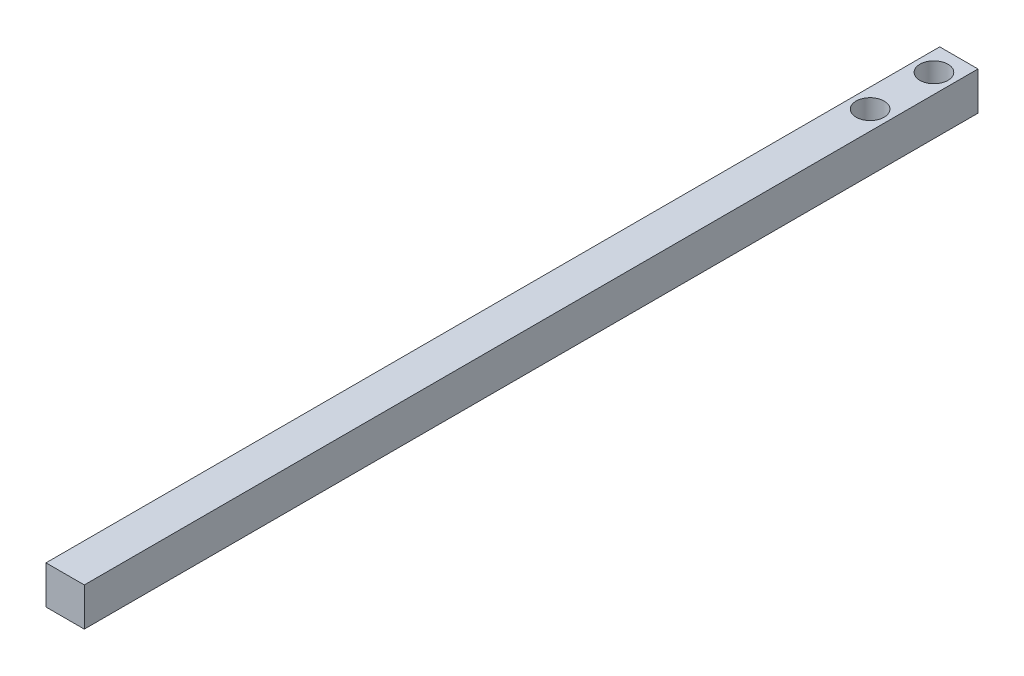
ISO-10303-21;
HEADER;
FILE_DESCRIPTION(('STEP AP214'),'2;1');
FILE_NAME('part.step','',(''),(''),'','','');
FILE_SCHEMA(('AUTOMOTIVE_DESIGN { 1 0 10303 214 1 1 1 1 }'));
ENDSEC;
DATA;
#1=APPLICATION_CONTEXT('core data for automotive mechanical design processes');
#2=APPLICATION_PROTOCOL_DEFINITION('international standard','automotive_design',2000,#1);
#3=PRODUCT_CONTEXT('',#1,'mechanical');
#4=PRODUCT('Part','Part','',(#3));
#5=PRODUCT_RELATED_PRODUCT_CATEGORY('part','',(#4));
#6=PRODUCT_DEFINITION_FORMATION('','',#4);
#7=PRODUCT_DEFINITION_CONTEXT('part definition',#1,'design');
#8=PRODUCT_DEFINITION('design','',#6,#7);
#9=PRODUCT_DEFINITION_SHAPE('','',#8);
#10=(LENGTH_UNIT() NAMED_UNIT(*) SI_UNIT(.MILLI.,.METRE.));
#11=(NAMED_UNIT(*) PLANE_ANGLE_UNIT() SI_UNIT($,.RADIAN.));
#12=(NAMED_UNIT(*) SI_UNIT($,.STERADIAN.) SOLID_ANGLE_UNIT());
#13=UNCERTAINTY_MEASURE_WITH_UNIT(LENGTH_MEASURE(1.E-05),#10,'distance_accuracy_value','');
#14=(GEOMETRIC_REPRESENTATION_CONTEXT(3) GLOBAL_UNCERTAINTY_ASSIGNED_CONTEXT((#13)) GLOBAL_UNIT_ASSIGNED_CONTEXT((#10,
#11,#12)) REPRESENTATION_CONTEXT('',''));
#15=CARTESIAN_POINT('',(0.,0.,0.));
#16=DIRECTION('',(0.,0.,1.));
#17=DIRECTION('',(1.,0.,0.));
#18=AXIS2_PLACEMENT_3D('',#15,#16,#17);
#19=CARTESIAN_POINT('',(0.,3.,0.));
#20=DIRECTION('',(1.,0.,0.));
#21=DIRECTION('',(0.,0.,-1.));
#22=AXIS2_PLACEMENT_3D('',#19,#20,#21);
#23=PLANE('',#22);
#24=DIRECTION('',(0.,0.,1.));
#25=VECTOR('',#24,1.);
#26=CARTESIAN_POINT('',(0.,0.,0.));
#27=LINE('',#26,#25);
#28=CARTESIAN_POINT('',(0.,0.,-70.));
#29=VERTEX_POINT('',#28);
#30=CARTESIAN_POINT('',(0.,0.,0.));
#31=VERTEX_POINT('',#30);
#32=EDGE_CURVE('E96',#29,#31,#27,.T.);
#33=ORIENTED_EDGE('',*,*,#32,.T.);
#34=DIRECTION('',(0.,-1.,0.));
#35=VECTOR('',#34,1.);
#36=CARTESIAN_POINT('',(0.,3.,0.));
#37=LINE('',#36,#35);
#38=CARTESIAN_POINT('',(0.,3.,0.));
#39=VERTEX_POINT('',#38);
#40=EDGE_CURVE('E11',#39,#31,#37,.T.);
#41=ORIENTED_EDGE('',*,*,#40,.F.);
#42=DIRECTION('',(0.,0.,1.));
#43=VECTOR('',#42,1.);
#44=CARTESIAN_POINT('',(0.,3.,0.));
#45=LINE('',#44,#43);
#46=CARTESIAN_POINT('',(0.,3.,-70.));
#47=VERTEX_POINT('',#46);
#48=EDGE_CURVE('E84',#47,#39,#45,.T.);
#49=ORIENTED_EDGE('',*,*,#48,.F.);
#50=DIRECTION('',(0.,-1.,0.));
#51=VECTOR('',#50,1.);
#52=CARTESIAN_POINT('',(0.,3.,-70.));
#53=LINE('',#52,#51);
#54=EDGE_CURVE('E92',#47,#29,#53,.T.);
#55=ORIENTED_EDGE('',*,*,#54,.T.);
#56=EDGE_LOOP('',(#33,#41,#49,#55));
#57=FACE_BOUND('',#56,.T.);
#58=ADVANCED_FACE('F33',(#57),#23,.F.);
#59=CARTESIAN_POINT('',(0.,3.,0.));
#60=DIRECTION('',(0.,0.,-1.));
#61=DIRECTION('',(-1.,0.,0.));
#62=AXIS2_PLACEMENT_3D('',#59,#60,#61);
#63=PLANE('',#62);
#64=DIRECTION('',(1.,0.,0.));
#65=VECTOR('',#64,1.);
#66=CARTESIAN_POINT('',(0.,0.,0.));
#67=LINE('',#66,#65);
#68=CARTESIAN_POINT('',(3.,0.,0.));
#69=VERTEX_POINT('',#68);
#70=EDGE_CURVE('E88',#31,#69,#67,.T.);
#71=ORIENTED_EDGE('',*,*,#70,.T.);
#72=DIRECTION('',(0.,-1.,0.));
#73=VECTOR('',#72,1.);
#74=CARTESIAN_POINT('',(3.,3.,0.));
#75=LINE('',#74,#73);
#76=CARTESIAN_POINT('',(3.,3.,0.));
#77=VERTEX_POINT('',#76);
#78=EDGE_CURVE('E41',#77,#69,#75,.T.);
#79=ORIENTED_EDGE('',*,*,#78,.F.);
#80=DIRECTION('',(1.,0.,0.));
#81=VECTOR('',#80,1.);
#82=CARTESIAN_POINT('',(0.,3.,0.));
#83=LINE('',#82,#81);
#84=EDGE_CURVE('E79',#39,#77,#83,.T.);
#85=ORIENTED_EDGE('',*,*,#84,.F.);
#86=ORIENTED_EDGE('',*,*,#40,.T.);
#87=EDGE_LOOP('',(#71,#79,#85,#86));
#88=FACE_BOUND('',#87,.T.);
#89=ADVANCED_FACE('F87',(#88),#63,.F.);
#90=CARTESIAN_POINT('',(3.,3.,0.));
#91=DIRECTION('',(-1.,0.,0.));
#92=DIRECTION('',(0.,0.,1.));
#93=AXIS2_PLACEMENT_3D('',#90,#91,#92);
#94=PLANE('',#93);
#95=DIRECTION('',(0.,0.,-1.));
#96=VECTOR('',#95,1.);
#97=CARTESIAN_POINT('',(3.,0.,0.));
#98=LINE('',#97,#96);
#99=CARTESIAN_POINT('',(2.99999999999999,0.,-70.));
#100=VERTEX_POINT('',#99);
#101=EDGE_CURVE('E66',#69,#100,#98,.T.);
#102=ORIENTED_EDGE('',*,*,#101,.T.);
#103=DIRECTION('',(0.,-1.,0.));
#104=VECTOR('',#103,1.);
#105=CARTESIAN_POINT('',(2.99999999999999,3.,-70.));
#106=LINE('',#105,#104);
#107=CARTESIAN_POINT('',(2.99999999999999,3.,-70.));
#108=VERTEX_POINT('',#107);
#109=EDGE_CURVE('E89',#108,#100,#106,.T.);
#110=ORIENTED_EDGE('',*,*,#109,.F.);
#111=DIRECTION('',(0.,0.,-1.));
#112=VECTOR('',#111,1.);
#113=CARTESIAN_POINT('',(3.,3.,0.));
#114=LINE('',#113,#112);
#115=EDGE_CURVE('E82',#77,#108,#114,.T.);
#116=ORIENTED_EDGE('',*,*,#115,.F.);
#117=ORIENTED_EDGE('',*,*,#78,.T.);
#118=EDGE_LOOP('',(#102,#110,#116,#117));
#119=FACE_BOUND('',#118,.T.);
#120=ADVANCED_FACE('F90',(#119),#94,.F.);
#121=CARTESIAN_POINT('',(0.,3.,-70.));
#122=DIRECTION('',(0.,0.,1.));
#123=DIRECTION('',(1.,0.,0.));
#124=AXIS2_PLACEMENT_3D('',#121,#122,#123);
#125=PLANE('',#124);
#126=DIRECTION('',(-1.,0.,0.));
#127=VECTOR('',#126,1.);
#128=CARTESIAN_POINT('',(0.,0.,-70.));
#129=LINE('',#128,#127);
#130=EDGE_CURVE('E72',#100,#29,#129,.T.);
#131=ORIENTED_EDGE('',*,*,#130,.T.);
#132=ORIENTED_EDGE('',*,*,#54,.F.);
#133=DIRECTION('',(-1.,0.,0.));
#134=VECTOR('',#133,1.);
#135=CARTESIAN_POINT('',(0.,3.,-70.));
#136=LINE('',#135,#134);
#137=EDGE_CURVE('E49',#108,#47,#136,.T.);
#138=ORIENTED_EDGE('',*,*,#137,.F.);
#139=ORIENTED_EDGE('',*,*,#109,.T.);
#140=EDGE_LOOP('',(#131,#132,#138,#139));
#141=FACE_BOUND('',#140,.T.);
#142=ADVANCED_FACE('F104',(#141),#125,.F.);
#143=CARTESIAN_POINT('',(0.,3.,0.));
#144=DIRECTION('',(0.,-1.,0.));
#145=DIRECTION('',(0.,0.,-1.));
#146=AXIS2_PLACEMENT_3D('',#143,#144,#145);
#147=PLANE('',#146);
#148=CARTESIAN_POINT('',(1.49999999999999,3.,-63.047484244251));
#149=DIRECTION('',(0.,1.,0.));
#150=DIRECTION('',(0.,0.,1.));
#151=AXIS2_PLACEMENT_3D('',#148,#149,#150);
#152=CIRCLE('',#151,1.1);
#153=CARTESIAN_POINT('',(1.49999999999999,3.,-61.947484244251));
#154=VERTEX_POINT('',#153);
#155=EDGE_CURVE('E116',#154,#154,#152,.T.);
#156=ORIENTED_EDGE('',*,*,#155,.F.);
#157=EDGE_LOOP('',(#156));
#158=FACE_BOUND('',#157,.T.);
#159=CARTESIAN_POINT('',(1.49999999999999,3.,-68.047484244251));
#160=DIRECTION('',(0.,1.,0.));
#161=DIRECTION('',(0.,0.,1.));
#162=AXIS2_PLACEMENT_3D('',#159,#160,#161);
#163=CIRCLE('',#162,1.1);
#164=CARTESIAN_POINT('',(1.49999999999999,3.,-66.947484244251));
#165=VERTEX_POINT('',#164);
#166=EDGE_CURVE('E110',#165,#165,#163,.T.);
#167=ORIENTED_EDGE('',*,*,#166,.F.);
#168=EDGE_LOOP('',(#167));
#169=FACE_BOUND('',#168,.T.);
#170=ORIENTED_EDGE('',*,*,#48,.T.);
#171=ORIENTED_EDGE('',*,*,#84,.T.);
#172=ORIENTED_EDGE('',*,*,#115,.T.);
#173=ORIENTED_EDGE('',*,*,#137,.T.);
#174=EDGE_LOOP('',(#170,#171,#172,#173));
#175=FACE_BOUND('',#174,.T.);
#176=ADVANCED_FACE('F80',(#158,#169,#175),#147,.F.);
#177=CARTESIAN_POINT('',(0.,0.,0.));
#178=DIRECTION('',(0.,-1.,0.));
#179=DIRECTION('',(0.,0.,-1.));
#180=AXIS2_PLACEMENT_3D('',#177,#178,#179);
#181=PLANE('',#180);
#182=CARTESIAN_POINT('',(1.49999999999999,0.,-63.047484244251));
#183=DIRECTION('',(0.,1.,0.));
#184=DIRECTION('',(0.,0.,1.));
#185=AXIS2_PLACEMENT_3D('',#182,#183,#184);
#186=CIRCLE('',#185,1.1);
#187=CARTESIAN_POINT('',(1.49999999999999,0.,-61.947484244251));
#188=VERTEX_POINT('',#187);
#189=EDGE_CURVE('E113',#188,#188,#186,.T.);
#190=ORIENTED_EDGE('',*,*,#189,.T.);
#191=EDGE_LOOP('',(#190));
#192=FACE_BOUND('',#191,.T.);
#193=CARTESIAN_POINT('',(1.49999999999999,0.,-68.047484244251));
#194=DIRECTION('',(0.,1.,0.));
#195=DIRECTION('',(0.,0.,1.));
#196=AXIS2_PLACEMENT_3D('',#193,#194,#195);
#197=CIRCLE('',#196,1.1);
#198=CARTESIAN_POINT('',(1.49999999999999,0.,-66.947484244251));
#199=VERTEX_POINT('',#198);
#200=EDGE_CURVE('E99',#199,#199,#197,.T.);
#201=ORIENTED_EDGE('',*,*,#200,.T.);
#202=EDGE_LOOP('',(#201));
#203=FACE_BOUND('',#202,.T.);
#204=ORIENTED_EDGE('',*,*,#32,.F.);
#205=ORIENTED_EDGE('',*,*,#130,.F.);
#206=ORIENTED_EDGE('',*,*,#101,.F.);
#207=ORIENTED_EDGE('',*,*,#70,.F.);
#208=EDGE_LOOP('',(#204,#205,#206,#207));
#209=FACE_BOUND('',#208,.T.);
#210=ADVANCED_FACE('F107',(#192,#203,#209),#181,.T.);
#211=CARTESIAN_POINT('',(1.49999999999999,0.,-68.047484244251));
#212=DIRECTION('',(0.,1.,0.));
#213=DIRECTION('',(0.,0.,1.));
#214=AXIS2_PLACEMENT_3D('',#211,#212,#213);
#215=CYLINDRICAL_SURFACE('',#214,1.1);
#216=ORIENTED_EDGE('',*,*,#200,.F.);
#217=EDGE_LOOP('',(#216));
#218=FACE_BOUND('',#217,.T.);
#219=ORIENTED_EDGE('',*,*,#166,.T.);
#220=EDGE_LOOP('',(#219));
#221=FACE_BOUND('',#220,.T.);
#222=ADVANCED_FACE('F127',(#218,#221),#215,.F.);
#223=CARTESIAN_POINT('',(1.49999999999999,0.,-63.047484244251));
#224=DIRECTION('',(0.,1.,0.));
#225=DIRECTION('',(0.,0.,1.));
#226=AXIS2_PLACEMENT_3D('',#223,#224,#225);
#227=CYLINDRICAL_SURFACE('',#226,1.1);
#228=ORIENTED_EDGE('',*,*,#189,.F.);
#229=EDGE_LOOP('',(#228));
#230=FACE_BOUND('',#229,.T.);
#231=ORIENTED_EDGE('',*,*,#155,.T.);
#232=EDGE_LOOP('',(#231));
#233=FACE_BOUND('',#232,.T.);
#234=ADVANCED_FACE('F124',(#230,#233),#227,.F.);
#235=CLOSED_SHELL('',(#58,#89,#120,#142,#176,#210,#222,#234));
#236=MANIFOLD_SOLID_BREP('B2',#235);
#237=ADVANCED_BREP_SHAPE_REPRESENTATION('',(#18,#236),#14);
#238=SHAPE_DEFINITION_REPRESENTATION(#9,#237);
ENDSEC;
END-ISO-10303-21;
